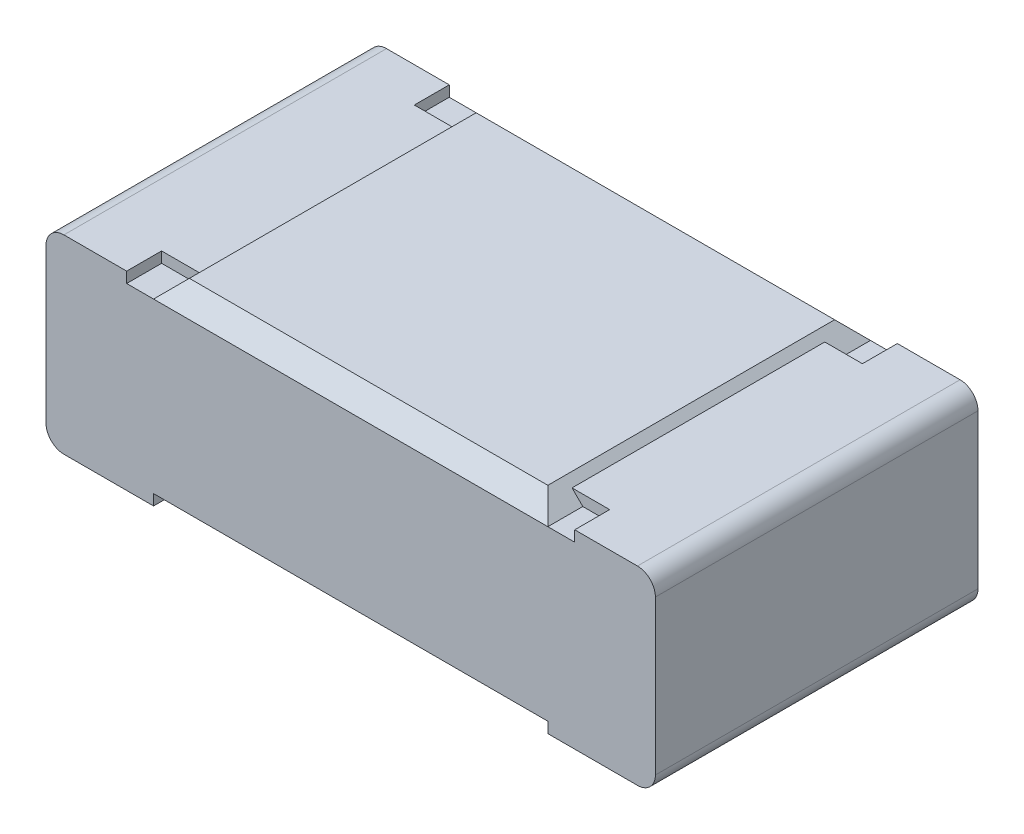
ISO-10303-21;
HEADER;
FILE_DESCRIPTION(('STEP AP214'),'2;1');
FILE_NAME('part.step','',(''),(''),'','','');
FILE_SCHEMA(('AUTOMOTIVE_DESIGN { 1 0 10303 214 1 1 1 1 }'));
ENDSEC;
DATA;
#1=APPLICATION_CONTEXT('core data for automotive mechanical design processes');
#2=APPLICATION_PROTOCOL_DEFINITION('international standard','automotive_design',2000,#1);
#3=PRODUCT_CONTEXT('',#1,'mechanical');
#4=PRODUCT('Part','Part','',(#3));
#5=PRODUCT_RELATED_PRODUCT_CATEGORY('part','',(#4));
#6=PRODUCT_DEFINITION_FORMATION('','',#4);
#7=PRODUCT_DEFINITION_CONTEXT('part definition',#1,'design');
#8=PRODUCT_DEFINITION('design','',#6,#7);
#9=PRODUCT_DEFINITION_SHAPE('','',#8);
#10=(LENGTH_UNIT() NAMED_UNIT(*) SI_UNIT(.MILLI.,.METRE.));
#11=(NAMED_UNIT(*) PLANE_ANGLE_UNIT() SI_UNIT($,.RADIAN.));
#12=(NAMED_UNIT(*) SI_UNIT($,.STERADIAN.) SOLID_ANGLE_UNIT());
#13=UNCERTAINTY_MEASURE_WITH_UNIT(LENGTH_MEASURE(1.E-05),#10,'distance_accuracy_value','');
#14=(GEOMETRIC_REPRESENTATION_CONTEXT(3) GLOBAL_UNCERTAINTY_ASSIGNED_CONTEXT((#13)) GLOBAL_UNIT_ASSIGNED_CONTEXT((#10,
#11,#12)) REPRESENTATION_CONTEXT('',''));
#15=CARTESIAN_POINT('',(0.,0.,0.));
#16=DIRECTION('',(0.,0.,1.));
#17=DIRECTION('',(1.,0.,0.));
#18=AXIS2_PLACEMENT_3D('',#15,#16,#17);
#19=CARTESIAN_POINT('',(-2.052710129873,-22.36241512988,3.046662858095));
#20=DIRECTION('',(1.,5.246547753537E-10,0.));
#21=DIRECTION('',(-5.246547753537E-10,1.,0.));
#22=AXIS2_PLACEMENT_3D('',#19,#20,#21);
#23=PLANE('',#22);
#24=DIRECTION('',(-5.246547753537E-10,1.,0.));
#25=VECTOR('',#24,1.);
#26=CARTESIAN_POINT('',(-2.052710129873,-22.36241512988,2.949162858095));
#27=LINE('',#26,#25);
#28=CARTESIAN_POINT('',(-2.052710129873,-22.362415130045,2.949162858095));
#29=VERTEX_POINT('',#28);
#30=CARTESIAN_POINT('',(-2.05271012988358,-22.3324151298794,2.949162858095));
#31=VERTEX_POINT('',#30);
#32=EDGE_CURVE('E396',#29,#31,#27,.T.);
#33=ORIENTED_EDGE('',*,*,#32,.F.);
#34=DIRECTION('',(0.,0.,1.));
#35=VECTOR('',#34,1.);
#36=CARTESIAN_POINT('',(-2.052710129873,-22.36241513021,3.849162858095));
#37=LINE('',#36,#35);
#38=CARTESIAN_POINT('',(-2.052710129873,-22.36241513021,3.046662858095));
#39=VERTEX_POINT('',#38);
#40=EDGE_CURVE('E246',#39,#29,#37,.F.);
#41=ORIENTED_EDGE('',*,*,#40,.F.);
#42=DIRECTION('',(0.,1.,0.));
#43=VECTOR('',#42,1.);
#44=CARTESIAN_POINT('',(-2.052710129873,-22.36241513053,3.046662858095));
#45=LINE('',#44,#43);
#46=CARTESIAN_POINT('',(-2.05271012988367,-22.3324151298788,3.046662858095));
#47=VERTEX_POINT('',#46);
#48=EDGE_CURVE('E380',#39,#47,#45,.T.);
#49=ORIENTED_EDGE('',*,*,#48,.T.);
#50=DIRECTION('',(0.,0.,1.));
#51=VECTOR('',#50,1.);
#52=CARTESIAN_POINT('',(-2.052710129889,-22.3324151298782,3.849162858095));
#53=LINE('',#52,#51);
#54=EDGE_CURVE('E341',#31,#47,#53,.T.);
#55=ORIENTED_EDGE('',*,*,#54,.F.);
#56=EDGE_LOOP('',(#33,#41,#49,#55));
#57=FACE_BOUND('',#56,.T.);
#58=ADVANCED_FACE('F17',(#57),#23,.F.);
#59=CARTESIAN_POINT('',(-3.302710129873,-22.36241513053,3.046662858095));
#60=DIRECTION('',(0.,0.,1.));
#61=DIRECTION('',(1.,0.,0.));
#62=AXIS2_PLACEMENT_3D('',#59,#60,#61);
#63=PLANE('',#62);
#64=DIRECTION('',(-1.,-5.246535065274E-10,0.));
#65=VECTOR('',#64,1.);
#66=CARTESIAN_POINT('',(-2.227710129889,-22.33241512997,3.046662858095));
#67=LINE('',#66,#65);
#68=CARTESIAN_POINT('',(-2.15771012988567,-22.3324151299338,3.046662858095));
#69=VERTEX_POINT('',#68);
#70=EDGE_CURVE('E337',#47,#69,#67,.T.);
#71=ORIENTED_EDGE('',*,*,#70,.F.);
#72=ORIENTED_EDGE('',*,*,#48,.F.);
#73=DIRECTION('',(-1.,0.,0.));
#74=VECTOR('',#73,1.);
#75=CARTESIAN_POINT('',(-3.477710129611,-22.36241513021,3.046662858095));
#76=LINE('',#75,#74);
#77=CARTESIAN_POINT('',(-2.127710129611,-22.36241513021,3.046662858095));
#78=VERTEX_POINT('',#77);
#79=EDGE_CURVE('E225',#78,#39,#76,.F.);
#80=ORIENTED_EDGE('',*,*,#79,.F.);
#81=DIRECTION('',(-0.707106781186548,0.707106781186548,0.));
#82=VECTOR('',#81,1.);
#83=CARTESIAN_POINT('',(-2.127710129611,-22.36241513021,3.046662858095));
#84=LINE('',#83,#82);
#85=EDGE_CURVE('E300',#69,#78,#84,.F.);
#86=ORIENTED_EDGE('',*,*,#85,.F.);
#87=EDGE_LOOP('',(#71,#72,#80,#86));
#88=FACE_BOUND('',#87,.T.);
#89=ADVANCED_FACE('F576',(#88),#63,.F.);
#90=CARTESIAN_POINT('',(-3.302710129873,-22.36241513053,2.949162858095));
#91=DIRECTION('',(-1.,-5.246547753537E-10,0.));
#92=DIRECTION('',(5.246547753537E-10,-1.,0.));
#93=AXIS2_PLACEMENT_3D('',#90,#91,#92);
#94=PLANE('',#93);
#95=DIRECTION('',(0.,1.,0.));
#96=VECTOR('',#95,1.);
#97=CARTESIAN_POINT('',(-3.302710129889,-22.36241513053,3.046662858095));
#98=LINE('',#97,#96);
#99=CARTESIAN_POINT('',(-3.302710129889,-22.3324151305188,3.046662858095));
#100=VERTEX_POINT('',#99);
#101=CARTESIAN_POINT('',(-3.30271012987833,-22.36241513021,3.046662858095));
#102=VERTEX_POINT('',#101);
#103=EDGE_CURVE('E363',#100,#102,#98,.F.);
#104=ORIENTED_EDGE('',*,*,#103,.T.);
#105=DIRECTION('',(0.,0.,1.));
#106=VECTOR('',#105,1.);
#107=CARTESIAN_POINT('',(-3.302710129873,-22.36241513021,3.849162858095));
#108=LINE('',#107,#106);
#109=CARTESIAN_POINT('',(-3.302710129877,-22.36241513045,2.949162858095));
#110=VERTEX_POINT('',#109);
#111=EDGE_CURVE('E376',#110,#102,#108,.T.);
#112=ORIENTED_EDGE('',*,*,#111,.F.);
#113=DIRECTION('',(0.,1.,0.));
#114=VECTOR('',#113,1.);
#115=CARTESIAN_POINT('',(-3.302710129889,-22.86241513021,2.949162858095));
#116=LINE('',#115,#114);
#117=CARTESIAN_POINT('',(-3.302710129889,-22.3324151305994,2.949162858095));
#118=VERTEX_POINT('',#117);
#119=EDGE_CURVE('E236',#118,#110,#116,.F.);
#120=ORIENTED_EDGE('',*,*,#119,.F.);
#121=DIRECTION('',(0.,0.,1.));
#122=VECTOR('',#121,1.);
#123=CARTESIAN_POINT('',(-3.302710129889,-22.3324151305382,3.849162858095));
#124=LINE('',#123,#122);
#125=EDGE_CURVE('E322',#100,#118,#124,.F.);
#126=ORIENTED_EDGE('',*,*,#125,.F.);
#127=EDGE_LOOP('',(#104,#112,#120,#126));
#128=FACE_BOUND('',#127,.T.);
#129=ADVANCED_FACE('F927',(#128),#94,.F.);
#130=CARTESIAN_POINT('',(-3.302710129873,-22.36241513053,3.046662858095));
#131=DIRECTION('',(0.,0.,1.));
#132=DIRECTION('',(1.,0.,0.));
#133=AXIS2_PLACEMENT_3D('',#130,#131,#132);
#134=PLANE('',#133);
#135=DIRECTION('',(-1.,0.,0.));
#136=VECTOR('',#135,1.);
#137=CARTESIAN_POINT('',(-3.477710129611,-22.36241513021,3.046662858095));
#138=LINE('',#137,#136);
#139=CARTESIAN_POINT('',(-3.227710129611,-22.36241513021,3.046662858095));
#140=VERTEX_POINT('',#139);
#141=EDGE_CURVE('E276',#102,#140,#138,.F.);
#142=ORIENTED_EDGE('',*,*,#141,.F.);
#143=ORIENTED_EDGE('',*,*,#103,.F.);
#144=DIRECTION('',(-1.,-5.24653823734E-10,0.));
#145=VECTOR('',#144,1.);
#146=CARTESIAN_POINT('',(-3.477710129889,-22.33241513063,3.046662858095));
#147=LINE('',#146,#145);
#148=CARTESIAN_POINT('',(-3.197710129882,-22.3324151304817,3.046662858095));
#149=VERTEX_POINT('',#148);
#150=EDGE_CURVE('E326',#149,#100,#147,.T.);
#151=ORIENTED_EDGE('',*,*,#150,.F.);
#152=DIRECTION('',(-0.707106781186548,-0.707106781186548,0.));
#153=VECTOR('',#152,1.);
#154=CARTESIAN_POINT('',(-3.227710129611,-22.36241513021,3.046662858095));
#155=LINE('',#154,#153);
#156=EDGE_CURVE('E299',#140,#149,#155,.F.);
#157=ORIENTED_EDGE('',*,*,#156,.F.);
#158=EDGE_LOOP('',(#142,#143,#151,#157));
#159=FACE_BOUND('',#158,.T.);
#160=ADVANCED_FACE('F633',(#159),#134,.F.);
#161=CARTESIAN_POINT('',(-2.052710129873,-22.36241512988,3.849162858095));
#162=DIRECTION('',(1.,5.246547753537E-10,0.));
#163=DIRECTION('',(-5.246547753537E-10,1.,0.));
#164=AXIS2_PLACEMENT_3D('',#161,#162,#163);
#165=PLANE('',#164);
#166=DIRECTION('',(0.,1.,0.));
#167=VECTOR('',#166,1.);
#168=CARTESIAN_POINT('',(-2.052710129889,-22.36241512988,3.751662858095));
#169=LINE('',#168,#167);
#170=CARTESIAN_POINT('',(-2.052710129889,-22.3324151298955,3.751662858095));
#171=VERTEX_POINT('',#170);
#172=CARTESIAN_POINT('',(-2.05271012987833,-22.36241513021,3.751662858095));
#173=VERTEX_POINT('',#172);
#174=EDGE_CURVE('E357',#171,#173,#169,.F.);
#175=ORIENTED_EDGE('',*,*,#174,.T.);
#176=DIRECTION('',(0.,0.,1.));
#177=VECTOR('',#176,1.);
#178=CARTESIAN_POINT('',(-2.052710129873,-22.36241513021,3.849162858095));
#179=LINE('',#178,#177);
#180=CARTESIAN_POINT('',(-2.052710129873,-22.362415130045,3.849162858095));
#181=VERTEX_POINT('',#180);
#182=EDGE_CURVE('E334',#181,#173,#179,.F.);
#183=ORIENTED_EDGE('',*,*,#182,.F.);
#184=DIRECTION('',(-5.246547753537E-10,1.,0.));
#185=VECTOR('',#184,1.);
#186=CARTESIAN_POINT('',(-2.052710129873,-22.36241512988,3.849162858095));
#187=LINE('',#186,#185);
#188=CARTESIAN_POINT('',(-2.05271012988358,-22.3324151298794,3.849162858095));
#189=VERTEX_POINT('',#188);
#190=EDGE_CURVE('E359',#189,#181,#187,.F.);
#191=ORIENTED_EDGE('',*,*,#190,.F.);
#192=DIRECTION('',(0.,0.,1.));
#193=VECTOR('',#192,1.);
#194=CARTESIAN_POINT('',(-2.052710129889,-22.3324151298782,3.849162858095));
#195=LINE('',#194,#193);
#196=EDGE_CURVE('E338',#171,#189,#195,.T.);
#197=ORIENTED_EDGE('',*,*,#196,.F.);
#198=EDGE_LOOP('',(#175,#183,#191,#197));
#199=FACE_BOUND('',#198,.T.);
#200=ADVANCED_FACE('F598',(#199),#165,.F.);
#201=CARTESIAN_POINT('',(-2.052710129873,-22.36241512988,3.751662858095));
#202=DIRECTION('',(0.,0.,-1.));
#203=DIRECTION('',(0.,1.,0.));
#204=AXIS2_PLACEMENT_3D('',#201,#202,#203);
#205=PLANE('',#204);
#206=DIRECTION('',(-1.,0.,0.));
#207=VECTOR('',#206,1.);
#208=CARTESIAN_POINT('',(-3.477710129611,-22.36241513021,3.751662858095));
#209=LINE('',#208,#207);
#210=CARTESIAN_POINT('',(-2.127710129611,-22.36241513021,3.751662858095));
#211=VERTEX_POINT('',#210);
#212=EDGE_CURVE('E351',#173,#211,#209,.T.);
#213=ORIENTED_EDGE('',*,*,#212,.F.);
#214=ORIENTED_EDGE('',*,*,#174,.F.);
#215=DIRECTION('',(-1.,-5.246535065274E-10,0.));
#216=VECTOR('',#215,1.);
#217=CARTESIAN_POINT('',(-2.227710129889,-22.33241512997,3.751662858095));
#218=LINE('',#217,#216);
#219=CARTESIAN_POINT('',(-2.157710129887,-22.3324151299338,3.751662858095));
#220=VERTEX_POINT('',#219);
#221=EDGE_CURVE('E342',#220,#171,#218,.F.);
#222=ORIENTED_EDGE('',*,*,#221,.F.);
#223=DIRECTION('',(-0.707106781186548,0.707106781186548,0.));
#224=VECTOR('',#223,1.);
#225=CARTESIAN_POINT('',(-2.127710129611,-22.36241513021,3.751662858095));
#226=LINE('',#225,#224);
#227=EDGE_CURVE('E345',#211,#220,#226,.T.);
#228=ORIENTED_EDGE('',*,*,#227,.F.);
#229=EDGE_LOOP('',(#213,#214,#222,#228));
#230=FACE_BOUND('',#229,.T.);
#231=ADVANCED_FACE('F566',(#230),#205,.F.);
#232=CARTESIAN_POINT('',(-2.227710129889,-22.33241512997,3.849162858095));
#233=DIRECTION('',(-5.246535065274E-10,1.,0.));
#234=DIRECTION('',(-1.,-5.246535065274E-10,0.));
#235=AXIS2_PLACEMENT_3D('',#232,#233,#234);
#236=PLANE('',#235);
#237=ORIENTED_EDGE('',*,*,#54,.T.);
#238=ORIENTED_EDGE('',*,*,#70,.T.);
#239=DIRECTION('',(0.,0.,1.));
#240=VECTOR('',#239,1.);
#241=CARTESIAN_POINT('',(-2.157710129887,-22.332415129934,3.849162858095));
#242=LINE('',#241,#240);
#243=EDGE_CURVE('E348',#220,#69,#242,.F.);
#244=ORIENTED_EDGE('',*,*,#243,.F.);
#245=ORIENTED_EDGE('',*,*,#221,.T.);
#246=ORIENTED_EDGE('',*,*,#196,.T.);
#247=DIRECTION('',(1.,0.,0.));
#248=VECTOR('',#247,1.);
#249=CARTESIAN_POINT('',(-2.677710129611,-22.33241512988,3.849162858095));
#250=LINE('',#249,#248);
#251=CARTESIAN_POINT('',(-1.877710129862,-22.332415129835,3.849162858095));
#252=VERTEX_POINT('',#251);
#253=EDGE_CURVE('E448',#189,#252,#250,.T.);
#254=ORIENTED_EDGE('',*,*,#253,.T.);
#255=DIRECTION('',(0.,0.,-1.));
#256=VECTOR('',#255,1.);
#257=CARTESIAN_POINT('',(-1.877710129862,-22.33241512979,3.849162858095));
#258=LINE('',#257,#256);
#259=CARTESIAN_POINT('',(-1.877710129862,-22.332415129835,2.949162858095));
#260=VERTEX_POINT('',#259);
#261=EDGE_CURVE('E198',#260,#252,#258,.F.);
#262=ORIENTED_EDGE('',*,*,#261,.F.);
#263=DIRECTION('',(1.,0.,0.));
#264=VECTOR('',#263,1.);
#265=CARTESIAN_POINT('',(-2.677710129611,-22.33241512988,2.949162858095));
#266=LINE('',#265,#264);
#267=EDGE_CURVE('E224',#31,#260,#266,.T.);
#268=ORIENTED_EDGE('',*,*,#267,.F.);
#269=EDGE_LOOP('',(#237,#238,#244,#245,#246,#254,#262,#268));
#270=FACE_BOUND('',#269,.T.);
#271=ADVANCED_FACE('F571',(#270),#236,.T.);
#272=CARTESIAN_POINT('',(-1.877710129862,-22.38241512979,3.849162858095));
#273=DIRECTION('',(0.,0.,-1.));
#274=DIRECTION('',(0.,1.,0.));
#275=AXIS2_PLACEMENT_3D('',#272,#273,#274);
#276=CYLINDRICAL_SURFACE('',#275,0.05);
#277=CARTESIAN_POINT('',(-1.877710129862,-22.38241512979,2.949162858095));
#278=DIRECTION('',(0.,0.,-1.));
#279=DIRECTION('',(0.,1.,0.));
#280=AXIS2_PLACEMENT_3D('',#277,#278,#279);
#281=CIRCLE('',#280,0.05);
#282=CARTESIAN_POINT('',(-1.827710129862,-22.382415129775,2.949162858095));
#283=VERTEX_POINT('',#282);
#284=EDGE_CURVE('E20',#260,#283,#281,.T.);
#285=ORIENTED_EDGE('',*,*,#284,.F.);
#286=ORIENTED_EDGE('',*,*,#261,.T.);
#287=CARTESIAN_POINT('',(-1.877710129862,-22.38241512979,3.849162858095));
#288=DIRECTION('',(0.,0.,-1.));
#289=DIRECTION('',(0.,1.,0.));
#290=AXIS2_PLACEMENT_3D('',#287,#288,#289);
#291=CIRCLE('',#290,0.05);
#292=CARTESIAN_POINT('',(-1.827710129862,-22.382415129775,3.849162858095));
#293=VERTEX_POINT('',#292);
#294=EDGE_CURVE('E209',#252,#293,#291,.T.);
#295=ORIENTED_EDGE('',*,*,#294,.T.);
#296=DIRECTION('',(0.,0.,1.));
#297=VECTOR('',#296,1.);
#298=CARTESIAN_POINT('',(-1.827710129862,-22.38241512976,3.849162858095));
#299=LINE('',#298,#297);
#300=EDGE_CURVE('E203',#283,#293,#299,.T.);
#301=ORIENTED_EDGE('',*,*,#300,.F.);
#302=EDGE_LOOP('',(#285,#286,#295,#301));
#303=FACE_BOUND('',#302,.T.);
#304=ADVANCED_FACE('F205',(#303),#276,.T.);
#305=CARTESIAN_POINT('',(-1.827710129862,-22.38241512976,3.849162858095));
#306=DIRECTION('',(1.,5.246545171623E-10,0.));
#307=DIRECTION('',(-5.246545171623E-10,1.,0.));
#308=AXIS2_PLACEMENT_3D('',#305,#306,#307);
#309=PLANE('',#308);
#310=DIRECTION('',(0.,1.,0.));
#311=VECTOR('',#310,1.);
#312=CARTESIAN_POINT('',(-1.827710129862,-22.86241513021,2.949162858095));
#313=LINE('',#312,#311);
#314=CARTESIAN_POINT('',(-1.8277101297495,-22.812415129775,2.949162858095));
#315=VERTEX_POINT('',#314);
#316=EDGE_CURVE('E215',#283,#315,#313,.F.);
#317=ORIENTED_EDGE('',*,*,#316,.F.);
#318=ORIENTED_EDGE('',*,*,#300,.T.);
#319=DIRECTION('',(0.,1.,0.));
#320=VECTOR('',#319,1.);
#321=CARTESIAN_POINT('',(-1.827710129862,-22.86241513021,3.849162858095));
#322=LINE('',#321,#320);
#323=CARTESIAN_POINT('',(-1.8277101297495,-22.812415129775,3.849162858095));
#324=VERTEX_POINT('',#323);
#325=EDGE_CURVE('E446',#293,#324,#322,.F.);
#326=ORIENTED_EDGE('',*,*,#325,.T.);
#327=DIRECTION('',(0.,0.,-1.));
#328=VECTOR('',#327,1.);
#329=CARTESIAN_POINT('',(-1.827710129637,-22.81241512976,3.849162858095));
#330=LINE('',#329,#328);
#331=EDGE_CURVE('E212',#315,#324,#330,.F.);
#332=ORIENTED_EDGE('',*,*,#331,.F.);
#333=EDGE_LOOP('',(#317,#318,#326,#332));
#334=FACE_BOUND('',#333,.T.);
#335=ADVANCED_FACE('F216',(#334),#309,.T.);
#336=CARTESIAN_POINT('',(-1.877710129637,-22.81241512979,3.849162858095));
#337=DIRECTION('',(0.,0.,-1.));
#338=DIRECTION('',(0.,1.,0.));
#339=AXIS2_PLACEMENT_3D('',#336,#337,#338);
#340=CYLINDRICAL_SURFACE('',#339,0.05);
#341=CARTESIAN_POINT('',(-1.877710129637,-22.81241512979,2.949162858095));
#342=DIRECTION('',(0.,0.,-1.));
#343=DIRECTION('',(0.,1.,0.));
#344=AXIS2_PLACEMENT_3D('',#341,#342,#343);
#345=CIRCLE('',#344,0.05);
#346=CARTESIAN_POINT('',(-1.87771012961088,-22.86241512979,2.949162858095));
#347=VERTEX_POINT('',#346);
#348=EDGE_CURVE('E220',#315,#347,#345,.T.);
#349=ORIENTED_EDGE('',*,*,#348,.F.);
#350=ORIENTED_EDGE('',*,*,#331,.T.);
#351=CARTESIAN_POINT('',(-1.877710129637,-22.81241512979,3.849162858095));
#352=DIRECTION('',(0.,0.,-1.));
#353=DIRECTION('',(0.,1.,0.));
#354=AXIS2_PLACEMENT_3D('',#351,#352,#353);
#355=CIRCLE('',#354,0.05);
#356=CARTESIAN_POINT('',(-1.877710129624,-22.86241512979,3.849162858095));
#357=VERTEX_POINT('',#356);
#358=EDGE_CURVE('E443',#324,#357,#355,.T.);
#359=ORIENTED_EDGE('',*,*,#358,.T.);
#360=DIRECTION('',(0.,0.,1.));
#361=VECTOR('',#360,1.);
#362=CARTESIAN_POINT('',(-1.877710129611,-22.86241512979,3.849162858095));
#363=LINE('',#362,#361);
#364=EDGE_CURVE('E331',#347,#357,#363,.T.);
#365=ORIENTED_EDGE('',*,*,#364,.F.);
#366=EDGE_LOOP('',(#349,#350,#359,#365));
#367=FACE_BOUND('',#366,.T.);
#368=ADVANCED_FACE('F461',(#367),#340,.T.);
#369=CARTESIAN_POINT('',(-3.477710129637,-22.81241513063,3.849162858095));
#370=DIRECTION('',(0.,0.,-1.));
#371=DIRECTION('',(0.,1.,0.));
#372=AXIS2_PLACEMENT_3D('',#369,#370,#371);
#373=CYLINDRICAL_SURFACE('',#372,0.05);
#374=CARTESIAN_POINT('',(-3.477710129637,-22.81241513063,2.949162858095));
#375=DIRECTION('',(0.,0.,-1.));
#376=DIRECTION('',(0.,1.,0.));
#377=AXIS2_PLACEMENT_3D('',#374,#375,#376);
#378=CIRCLE('',#377,0.05);
#379=CARTESIAN_POINT('',(-3.477710129624,-22.8624151305556,2.949162858095));
#380=VERTEX_POINT('',#379);
#381=CARTESIAN_POINT('',(-3.527710129637,-22.81241513064,2.949162858095));
#382=VERTEX_POINT('',#381);
#383=EDGE_CURVE('E454',#380,#382,#378,.T.);
#384=ORIENTED_EDGE('',*,*,#383,.F.);
#385=DIRECTION('',(0.,0.,1.));
#386=VECTOR('',#385,1.);
#387=CARTESIAN_POINT('',(-3.477710129611,-22.8624151306212,3.849162858095));
#388=LINE('',#387,#386);
#389=CARTESIAN_POINT('',(-3.477710129624,-22.8624151305556,3.849162858095));
#390=VERTEX_POINT('',#389);
#391=EDGE_CURVE('E269',#390,#380,#388,.F.);
#392=ORIENTED_EDGE('',*,*,#391,.F.);
#393=CARTESIAN_POINT('',(-3.477710129637,-22.81241513063,3.849162858095));
#394=DIRECTION('',(0.,0.,-1.));
#395=DIRECTION('',(0.,1.,0.));
#396=AXIS2_PLACEMENT_3D('',#393,#394,#395);
#397=CIRCLE('',#396,0.05);
#398=CARTESIAN_POINT('',(-3.527710129637,-22.81241513064,3.849162858095));
#399=VERTEX_POINT('',#398);
#400=EDGE_CURVE('E440',#390,#399,#397,.T.);
#401=ORIENTED_EDGE('',*,*,#400,.T.);
#402=DIRECTION('',(0.,0.,1.));
#403=VECTOR('',#402,1.);
#404=CARTESIAN_POINT('',(-3.527710129637,-22.81241513065,3.849162858095));
#405=LINE('',#404,#403);
#406=EDGE_CURVE('E327',#382,#399,#405,.T.);
#407=ORIENTED_EDGE('',*,*,#406,.F.);
#408=EDGE_LOOP('',(#384,#392,#401,#407));
#409=FACE_BOUND('',#408,.T.);
#410=ADVANCED_FACE('F611',(#409),#373,.T.);
#411=CARTESIAN_POINT('',(-3.527710129637,-22.81241513065,3.849162858095));
#412=DIRECTION('',(-1.,-5.246547753537E-10,0.));
#413=DIRECTION('',(5.246547753537E-10,-1.,0.));
#414=AXIS2_PLACEMENT_3D('',#411,#412,#413);
#415=PLANE('',#414);
#416=DIRECTION('',(0.,1.,0.));
#417=VECTOR('',#416,1.);
#418=CARTESIAN_POINT('',(-3.527710129637,-22.86241513021,2.949162858095));
#419=LINE('',#418,#417);
#420=CARTESIAN_POINT('',(-3.5277101297495,-22.38241513064,2.949162858095));
#421=VERTEX_POINT('',#420);
#422=EDGE_CURVE('E453',#382,#421,#419,.T.);
#423=ORIENTED_EDGE('',*,*,#422,.F.);
#424=ORIENTED_EDGE('',*,*,#406,.T.);
#425=DIRECTION('',(0.,1.,0.));
#426=VECTOR('',#425,1.);
#427=CARTESIAN_POINT('',(-3.527710129637,-22.86241513021,3.849162858095));
#428=LINE('',#427,#426);
#429=CARTESIAN_POINT('',(-3.5277101297495,-22.38241513064,3.849162858095));
#430=VERTEX_POINT('',#429);
#431=EDGE_CURVE('E439',#399,#430,#428,.T.);
#432=ORIENTED_EDGE('',*,*,#431,.T.);
#433=DIRECTION('',(0.,0.,-1.));
#434=VECTOR('',#433,1.);
#435=CARTESIAN_POINT('',(-3.527710129862,-22.38241513065,3.849162858095));
#436=LINE('',#435,#434);
#437=EDGE_CURVE('E323',#421,#430,#436,.F.);
#438=ORIENTED_EDGE('',*,*,#437,.F.);
#439=EDGE_LOOP('',(#423,#424,#432,#438));
#440=FACE_BOUND('',#439,.T.);
#441=ADVANCED_FACE('F615',(#440),#415,.T.);
#442=CARTESIAN_POINT('',(-3.477710129862,-22.38241513063,3.849162858095));
#443=DIRECTION('',(0.,0.,-1.));
#444=DIRECTION('',(0.,1.,0.));
#445=AXIS2_PLACEMENT_3D('',#442,#443,#444);
#446=CYLINDRICAL_SURFACE('',#445,0.05);
#447=CARTESIAN_POINT('',(-3.477710129862,-22.38241513063,2.949162858095));
#448=DIRECTION('',(0.,0.,-1.));
#449=DIRECTION('',(0.,1.,0.));
#450=AXIS2_PLACEMENT_3D('',#447,#448,#449);
#451=CIRCLE('',#450,0.05);
#452=CARTESIAN_POINT('',(-3.4777101298755,-22.33241513063,2.949162858095));
#453=VERTEX_POINT('',#452);
#454=EDGE_CURVE('E449',#421,#453,#451,.T.);
#455=ORIENTED_EDGE('',*,*,#454,.F.);
#456=ORIENTED_EDGE('',*,*,#437,.T.);
#457=CARTESIAN_POINT('',(-3.477710129862,-22.38241513063,3.849162858095));
#458=DIRECTION('',(0.,0.,-1.));
#459=DIRECTION('',(0.,1.,0.));
#460=AXIS2_PLACEMENT_3D('',#457,#458,#459);
#461=CIRCLE('',#460,0.05);
#462=CARTESIAN_POINT('',(-3.4777101298755,-22.33241513063,3.849162858095));
#463=VERTEX_POINT('',#462);
#464=EDGE_CURVE('E436',#430,#463,#461,.T.);
#465=ORIENTED_EDGE('',*,*,#464,.T.);
#466=DIRECTION('',(0.,0.,1.));
#467=VECTOR('',#466,1.);
#468=CARTESIAN_POINT('',(-3.477710129889,-22.33241513063,3.849162858095));
#469=LINE('',#468,#467);
#470=EDGE_CURVE('E317',#453,#463,#469,.T.);
#471=ORIENTED_EDGE('',*,*,#470,.F.);
#472=EDGE_LOOP('',(#455,#456,#465,#471));
#473=FACE_BOUND('',#472,.T.);
#474=ADVANCED_FACE('F619',(#473),#446,.T.);
#475=CARTESIAN_POINT('',(-3.477710129889,-22.33241513063,3.849162858095));
#476=DIRECTION('',(-5.24653823734E-10,1.,0.));
#477=DIRECTION('',(-1.,-5.24653823734E-10,0.));
#478=AXIS2_PLACEMENT_3D('',#475,#476,#477);
#479=PLANE('',#478);
#480=DIRECTION('',(0.,0.,1.));
#481=VECTOR('',#480,1.);
#482=CARTESIAN_POINT('',(-3.30271012988874,-22.33241513053,3.751662858095));
#483=LINE('',#482,#481);
#484=CARTESIAN_POINT('',(-3.30271012988891,-22.3324151305967,3.849162858095));
#485=VERTEX_POINT('',#484);
#486=CARTESIAN_POINT('',(-3.30271012988177,-22.33241513053,3.751662858095));
#487=VERTEX_POINT('',#486);
#488=EDGE_CURVE('E307',#485,#487,#483,.F.);
#489=ORIENTED_EDGE('',*,*,#488,.T.);
#490=DIRECTION('',(1.,0.,0.));
#491=VECTOR('',#490,1.);
#492=CARTESIAN_POINT('',(-2.052710129873,-22.33241513053,3.751662858095));
#493=LINE('',#492,#491);
#494=CARTESIAN_POINT('',(-3.19771012989525,-22.3324151304943,3.751662858095));
#495=VERTEX_POINT('',#494);
#496=EDGE_CURVE('E306',#487,#495,#493,.T.);
#497=ORIENTED_EDGE('',*,*,#496,.T.);
#498=DIRECTION('',(0.,0.,1.));
#499=VECTOR('',#498,1.);
#500=CARTESIAN_POINT('',(-3.197710129882,-22.332415130481,2.949162858095));
#501=LINE('',#500,#499);
#502=EDGE_CURVE('E289',#149,#495,#501,.T.);
#503=ORIENTED_EDGE('',*,*,#502,.F.);
#504=ORIENTED_EDGE('',*,*,#150,.T.);
#505=ORIENTED_EDGE('',*,*,#125,.T.);
#506=DIRECTION('',(1.,0.,0.));
#507=VECTOR('',#506,1.);
#508=CARTESIAN_POINT('',(-2.677710129611,-22.33241513063,2.949162858095));
#509=LINE('',#508,#507);
#510=EDGE_CURVE('E452',#453,#118,#509,.T.);
#511=ORIENTED_EDGE('',*,*,#510,.F.);
#512=ORIENTED_EDGE('',*,*,#470,.T.);
#513=DIRECTION('',(1.,0.,0.));
#514=VECTOR('',#513,1.);
#515=CARTESIAN_POINT('',(-2.677710129611,-22.33241513063,3.849162858095));
#516=LINE('',#515,#514);
#517=EDGE_CURVE('E438',#463,#485,#516,.T.);
#518=ORIENTED_EDGE('',*,*,#517,.T.);
#519=EDGE_LOOP('',(#489,#497,#503,#504,#505,#511,#512,#518));
#520=FACE_BOUND('',#519,.T.);
#521=ADVANCED_FACE('F623',(#520),#479,.T.);
#522=CARTESIAN_POINT('',(-3.302710129873,-22.36241513053,3.751662858095));
#523=DIRECTION('',(-1.,-5.246547753537E-10,0.));
#524=DIRECTION('',(5.246547753537E-10,-1.,0.));
#525=AXIS2_PLACEMENT_3D('',#522,#523,#524);
#526=PLANE('',#525);
#527=DIRECTION('',(0.,1.,0.));
#528=VECTOR('',#527,1.);
#529=CARTESIAN_POINT('',(-3.302710129889,-22.86241513021,3.849162858095));
#530=LINE('',#529,#528);
#531=CARTESIAN_POINT('',(-3.302710129877,-22.36241513045,3.849162858095));
#532=VERTEX_POINT('',#531);
#533=EDGE_CURVE('E646',#485,#532,#530,.F.);
#534=ORIENTED_EDGE('',*,*,#533,.T.);
#535=DIRECTION('',(0.,0.,1.));
#536=VECTOR('',#535,1.);
#537=CARTESIAN_POINT('',(-3.302710129873,-22.36241513021,3.849162858095));
#538=LINE('',#537,#536);
#539=CARTESIAN_POINT('',(-3.302710129873,-22.36241513021,3.751662858095));
#540=VERTEX_POINT('',#539);
#541=EDGE_CURVE('E644',#540,#532,#538,.T.);
#542=ORIENTED_EDGE('',*,*,#541,.F.);
#543=DIRECTION('',(0.,1.,0.));
#544=VECTOR('',#543,1.);
#545=CARTESIAN_POINT('',(-3.302710129873,-22.36241512988,3.751662858095));
#546=LINE('',#545,#544);
#547=EDGE_CURVE('E303',#540,#487,#546,.T.);
#548=ORIENTED_EDGE('',*,*,#547,.T.);
#549=ORIENTED_EDGE('',*,*,#488,.F.);
#550=EDGE_LOOP('',(#534,#542,#548,#549));
#551=FACE_BOUND('',#550,.T.);
#552=ADVANCED_FACE('F661',(#551),#526,.F.);
#553=CARTESIAN_POINT('',(-2.052710129873,-22.36241512988,3.751662858095));
#554=DIRECTION('',(0.,0.,-1.));
#555=DIRECTION('',(0.,1.,0.));
#556=AXIS2_PLACEMENT_3D('',#553,#554,#555);
#557=PLANE('',#556);
#558=ORIENTED_EDGE('',*,*,#496,.F.);
#559=ORIENTED_EDGE('',*,*,#547,.F.);
#560=DIRECTION('',(-1.,0.,0.));
#561=VECTOR('',#560,1.);
#562=CARTESIAN_POINT('',(-3.477710129611,-22.36241513021,3.751662858095));
#563=LINE('',#562,#561);
#564=CARTESIAN_POINT('',(-3.227710129611,-22.36241513021,3.751662858095));
#565=VERTEX_POINT('',#564);
#566=EDGE_CURVE('E310',#565,#540,#563,.T.);
#567=ORIENTED_EDGE('',*,*,#566,.F.);
#568=DIRECTION('',(-0.707106781186548,-0.707106781186548,0.));
#569=VECTOR('',#568,1.);
#570=CARTESIAN_POINT('',(-3.227710129611,-22.36241513021,3.751662858095));
#571=LINE('',#570,#569);
#572=EDGE_CURVE('E285',#495,#565,#571,.T.);
#573=ORIENTED_EDGE('',*,*,#572,.F.);
#574=EDGE_LOOP('',(#558,#559,#567,#573));
#575=FACE_BOUND('',#574,.T.);
#576=ADVANCED_FACE('F640',(#575),#557,.F.);
#577=CARTESIAN_POINT('',(-2.127710129611,-22.36241513021,3.849162858095));
#578=DIRECTION('',(0.707106781186548,0.707106781186548,0.));
#579=DIRECTION('',(-0.707106781186548,0.707106781186548,0.));
#580=AXIS2_PLACEMENT_3D('',#577,#578,#579);
#581=PLANE('',#580);
#582=DIRECTION('',(-0.577350269189616,0.577350269189631,-0.577350269189631));
#583=VECTOR('',#582,1.);
#584=CARTESIAN_POINT('',(-2.127710129611,-22.36241513021,3.849162858095));
#585=LINE('',#584,#583);
#586=CARTESIAN_POINT('',(-2.127710129611,-22.36241513021,3.849162858095));
#587=VERTEX_POINT('',#586);
#588=CARTESIAN_POINT('',(-2.177710129611,-22.31241513021,3.799162858095));
#589=VERTEX_POINT('',#588);
#590=EDGE_CURVE('E294',#587,#589,#585,.T.);
#591=ORIENTED_EDGE('',*,*,#590,.F.);
#592=DIRECTION('',(0.,0.,1.));
#593=VECTOR('',#592,1.);
#594=CARTESIAN_POINT('',(-2.127710129611,-22.36241513021,3.849162858095));
#595=LINE('',#594,#593);
#596=EDGE_CURVE('E354',#211,#587,#595,.T.);
#597=ORIENTED_EDGE('',*,*,#596,.F.);
#598=ORIENTED_EDGE('',*,*,#227,.T.);
#599=ORIENTED_EDGE('',*,*,#243,.T.);
#600=ORIENTED_EDGE('',*,*,#85,.T.);
#601=DIRECTION('',(0.,0.,1.));
#602=VECTOR('',#601,1.);
#603=CARTESIAN_POINT('',(-2.127710129611,-22.36241513021,3.849162858095));
#604=LINE('',#603,#602);
#605=CARTESIAN_POINT('',(-2.127710129611,-22.36241513021,2.949162858095));
#606=VERTEX_POINT('',#605);
#607=EDGE_CURVE('E228',#606,#78,#604,.T.);
#608=ORIENTED_EDGE('',*,*,#607,.F.);
#609=DIRECTION('',(0.577350269189616,-0.577350269189631,-0.577350269189631));
#610=VECTOR('',#609,1.);
#611=CARTESIAN_POINT('',(-2.177710129611,-22.31241513021,2.999162858095));
#612=LINE('',#611,#610);
#613=CARTESIAN_POINT('',(-2.177710129611,-22.31241513021,2.999162858095));
#614=VERTEX_POINT('',#613);
#615=EDGE_CURVE('E249',#614,#606,#612,.T.);
#616=ORIENTED_EDGE('',*,*,#615,.F.);
#617=DIRECTION('',(0.,0.,1.));
#618=VECTOR('',#617,1.);
#619=CARTESIAN_POINT('',(-2.177710129611,-22.31241513021,3.399162858095));
#620=LINE('',#619,#618);
#621=EDGE_CURVE('E297',#589,#614,#620,.F.);
#622=ORIENTED_EDGE('',*,*,#621,.F.);
#623=EDGE_LOOP('',(#591,#597,#598,#599,#600,#608,#616,#622));
#624=FACE_BOUND('',#623,.T.);
#625=ADVANCED_FACE('F559',(#624),#581,.T.);
#626=CARTESIAN_POINT('',(-2.677710129611,-22.31241513021,3.399162858095));
#627=DIRECTION('',(0.,1.,0.));
#628=DIRECTION('',(-1.,0.,0.));
#629=AXIS2_PLACEMENT_3D('',#626,#627,#628);
#630=PLANE('',#629);
#631=DIRECTION('',(1.,0.,0.));
#632=VECTOR('',#631,1.);
#633=CARTESIAN_POINT('',(-3.227710129611,-22.31241513021,3.799162858095));
#634=LINE('',#633,#632);
#635=CARTESIAN_POINT('',(-3.177710129611,-22.31241513021,3.799162858095));
#636=VERTEX_POINT('',#635);
#637=EDGE_CURVE('E290',#589,#636,#634,.F.);
#638=ORIENTED_EDGE('',*,*,#637,.F.);
#639=ORIENTED_EDGE('',*,*,#621,.T.);
#640=DIRECTION('',(1.,0.,0.));
#641=VECTOR('',#640,1.);
#642=CARTESIAN_POINT('',(-2.127710129611,-22.31241513021,2.999162858095));
#643=LINE('',#642,#641);
#644=CARTESIAN_POINT('',(-3.177710129611,-22.31241513021,2.999162858095));
#645=VERTEX_POINT('',#644);
#646=EDGE_CURVE('E263',#645,#614,#643,.T.);
#647=ORIENTED_EDGE('',*,*,#646,.F.);
#648=DIRECTION('',(0.,0.,1.));
#649=VECTOR('',#648,1.);
#650=CARTESIAN_POINT('',(-3.177710129611,-22.31241513021,2.949162858095));
#651=LINE('',#650,#649);
#652=EDGE_CURVE('E288',#636,#645,#651,.F.);
#653=ORIENTED_EDGE('',*,*,#652,.F.);
#654=EDGE_LOOP('',(#638,#639,#647,#653));
#655=FACE_BOUND('',#654,.T.);
#656=ADVANCED_FACE('F585',(#655),#630,.T.);
#657=CARTESIAN_POINT('',(-3.227710129611,-22.36241513021,2.949162858095));
#658=DIRECTION('',(-0.707106781186548,0.707106781186548,0.));
#659=DIRECTION('',(-0.707106781186548,-0.707106781186548,0.));
#660=AXIS2_PLACEMENT_3D('',#657,#658,#659);
#661=PLANE('',#660);
#662=DIRECTION('',(0.577350269189614,0.577350269189634,0.577350269189629));
#663=VECTOR('',#662,1.);
#664=CARTESIAN_POINT('',(-3.227710129611,-22.36241513021,2.949162858095));
#665=LINE('',#664,#663);
#666=CARTESIAN_POINT('',(-3.22771012962433,-22.3624151303033,2.94916285808167));
#667=VERTEX_POINT('',#666);
#668=EDGE_CURVE('E266',#667,#645,#665,.T.);
#669=ORIENTED_EDGE('',*,*,#668,.F.);
#670=DIRECTION('',(0.,0.,1.));
#671=VECTOR('',#670,1.);
#672=CARTESIAN_POINT('',(-3.227710129611,-22.36241513021,3.849162858095));
#673=LINE('',#672,#671);
#674=EDGE_CURVE('E272',#140,#667,#673,.F.);
#675=ORIENTED_EDGE('',*,*,#674,.F.);
#676=ORIENTED_EDGE('',*,*,#156,.T.);
#677=ORIENTED_EDGE('',*,*,#502,.T.);
#678=ORIENTED_EDGE('',*,*,#572,.T.);
#679=DIRECTION('',(0.,0.,1.));
#680=VECTOR('',#679,1.);
#681=CARTESIAN_POINT('',(-3.227710129611,-22.36241513021,3.849162858095));
#682=LINE('',#681,#680);
#683=CARTESIAN_POINT('',(-3.227710129611,-22.36241513021,3.849162858095));
#684=VERTEX_POINT('',#683);
#685=EDGE_CURVE('E313',#684,#565,#682,.F.);
#686=ORIENTED_EDGE('',*,*,#685,.F.);
#687=DIRECTION('',(-0.577350269189614,-0.577350269189634,0.577350269189629));
#688=VECTOR('',#687,1.);
#689=CARTESIAN_POINT('',(-3.177710129611,-22.31241513021,3.799162858095));
#690=LINE('',#689,#688);
#691=EDGE_CURVE('E293',#636,#684,#690,.T.);
#692=ORIENTED_EDGE('',*,*,#691,.F.);
#693=ORIENTED_EDGE('',*,*,#652,.T.);
#694=EDGE_LOOP('',(#669,#675,#676,#677,#678,#686,#692,#693));
#695=FACE_BOUND('',#694,.T.);
#696=ADVANCED_FACE('F589',(#695),#661,.T.);
#697=CARTESIAN_POINT('',(-3.227710129611,-22.86241513049,3.849162858095));
#698=DIRECTION('',(5.246539561619E-10,-1.,0.));
#699=DIRECTION('',(1.,5.246539561619E-10,0.));
#700=AXIS2_PLACEMENT_3D('',#697,#698,#699);
#701=PLANE('',#700);
#702=DIRECTION('',(1.,0.,0.));
#703=VECTOR('',#702,1.);
#704=CARTESIAN_POINT('',(-2.677710129611,-22.86241513049,2.949162858095));
#705=LINE('',#704,#703);
#706=CARTESIAN_POINT('',(-3.22771012961551,-22.86241513049,2.949162858095));
#707=VERTEX_POINT('',#706);
#708=EDGE_CURVE('E456',#707,#380,#705,.F.);
#709=ORIENTED_EDGE('',*,*,#708,.F.);
#710=DIRECTION('',(0.,0.,1.));
#711=VECTOR('',#710,1.);
#712=CARTESIAN_POINT('',(-3.22771012961026,-22.86241513049,3.849162858095));
#713=LINE('',#712,#711);
#714=CARTESIAN_POINT('',(-3.22771012961551,-22.86241513049,3.849162858095));
#715=VERTEX_POINT('',#714);
#716=EDGE_CURVE('E279',#715,#707,#713,.F.);
#717=ORIENTED_EDGE('',*,*,#716,.F.);
#718=DIRECTION('',(1.,0.,0.));
#719=VECTOR('',#718,1.);
#720=CARTESIAN_POINT('',(-2.677710129611,-22.86241513049,3.849162858095));
#721=LINE('',#720,#719);
#722=EDGE_CURVE('E442',#715,#390,#721,.F.);
#723=ORIENTED_EDGE('',*,*,#722,.T.);
#724=ORIENTED_EDGE('',*,*,#391,.T.);
#725=EDGE_LOOP('',(#709,#717,#723,#724));
#726=FACE_BOUND('',#725,.T.);
#727=ADVANCED_FACE('F607',(#726),#701,.T.);
#728=CARTESIAN_POINT('',(-2.127710129611,-22.36241513021,2.949162858095));
#729=DIRECTION('',(0.,0.707106781186548,-0.707106781186548));
#730=DIRECTION('',(0.,0.707106781186548,0.707106781186548));
#731=AXIS2_PLACEMENT_3D('',#728,#729,#730);
#732=PLANE('',#731);
#733=ORIENTED_EDGE('',*,*,#646,.T.);
#734=ORIENTED_EDGE('',*,*,#615,.T.);
#735=DIRECTION('',(1.,0.,0.));
#736=VECTOR('',#735,1.);
#737=CARTESIAN_POINT('',(-2.677710129611,-22.36241513021,2.949162858095));
#738=LINE('',#737,#736);
#739=EDGE_CURVE('E243',#667,#606,#738,.T.);
#740=ORIENTED_EDGE('',*,*,#739,.F.);
#741=ORIENTED_EDGE('',*,*,#668,.T.);
#742=EDGE_LOOP('',(#733,#734,#740,#741));
#743=FACE_BOUND('',#742,.T.);
#744=ADVANCED_FACE('F582',(#743),#732,.T.);
#745=CARTESIAN_POINT('',(-3.477710129611,-22.36241513021,3.849162858095));
#746=DIRECTION('',(0.,1.,0.));
#747=DIRECTION('',(-1.,0.,0.));
#748=AXIS2_PLACEMENT_3D('',#745,#746,#747);
#749=PLANE('',#748);
#750=ORIENTED_EDGE('',*,*,#607,.T.);
#751=ORIENTED_EDGE('',*,*,#79,.T.);
#752=ORIENTED_EDGE('',*,*,#40,.T.);
#753=DIRECTION('',(1.,0.,0.));
#754=VECTOR('',#753,1.);
#755=CARTESIAN_POINT('',(-2.677710129611,-22.36241513021,2.949162858095));
#756=LINE('',#755,#754);
#757=EDGE_CURVE('E239',#606,#29,#756,.T.);
#758=ORIENTED_EDGE('',*,*,#757,.F.);
#759=EDGE_LOOP('',(#750,#751,#752,#758));
#760=FACE_BOUND('',#759,.T.);
#761=ADVANCED_FACE('F579',(#760),#749,.T.);
#762=CARTESIAN_POINT('',(-3.477710129611,-22.36241513021,3.849162858095));
#763=DIRECTION('',(0.,1.,0.));
#764=DIRECTION('',(-1.,0.,0.));
#765=AXIS2_PLACEMENT_3D('',#762,#763,#764);
#766=PLANE('',#765);
#767=ORIENTED_EDGE('',*,*,#674,.T.);
#768=DIRECTION('',(1.,0.,0.));
#769=VECTOR('',#768,1.);
#770=CARTESIAN_POINT('',(-2.677710129611,-22.36241513053,2.949162858095));
#771=LINE('',#770,#769);
#772=EDGE_CURVE('E242',#110,#667,#771,.T.);
#773=ORIENTED_EDGE('',*,*,#772,.F.);
#774=ORIENTED_EDGE('',*,*,#111,.T.);
#775=ORIENTED_EDGE('',*,*,#141,.T.);
#776=EDGE_LOOP('',(#767,#773,#774,#775));
#777=FACE_BOUND('',#776,.T.);
#778=ADVANCED_FACE('F628',(#777),#766,.T.);
#779=CARTESIAN_POINT('',(-1.877710129611,-22.86241512979,3.849162858095));
#780=DIRECTION('',(5.246539649706E-10,-1.,0.));
#781=DIRECTION('',(1.,5.246539649706E-10,0.));
#782=AXIS2_PLACEMENT_3D('',#779,#780,#781);
#783=PLANE('',#782);
#784=DIRECTION('',(1.,5.246539649706E-10,0.));
#785=VECTOR('',#784,1.);
#786=CARTESIAN_POINT('',(-1.877710129611,-22.86241512979,2.949162858095));
#787=LINE('',#786,#785);
#788=CARTESIAN_POINT('',(-2.127710129611,-22.8624151298771,2.949162858095));
#789=VERTEX_POINT('',#788);
#790=EDGE_CURVE('E275',#789,#347,#787,.T.);
#791=ORIENTED_EDGE('',*,*,#790,.T.);
#792=ORIENTED_EDGE('',*,*,#364,.T.);
#793=DIRECTION('',(1.,0.,0.));
#794=VECTOR('',#793,1.);
#795=CARTESIAN_POINT('',(-2.677710129611,-22.86241512979,3.849162858095));
#796=LINE('',#795,#794);
#797=CARTESIAN_POINT('',(-2.127710129611,-22.8624151298767,3.849162858095));
#798=VERTEX_POINT('',#797);
#799=EDGE_CURVE('E445',#357,#798,#796,.F.);
#800=ORIENTED_EDGE('',*,*,#799,.T.);
#801=DIRECTION('',(0.,0.,1.));
#802=VECTOR('',#801,1.);
#803=CARTESIAN_POINT('',(-2.127710129611,-22.86241512992,3.849162858095));
#804=LINE('',#803,#802);
#805=EDGE_CURVE('E466',#789,#798,#804,.T.);
#806=ORIENTED_EDGE('',*,*,#805,.F.);
#807=EDGE_LOOP('',(#791,#792,#800,#806));
#808=FACE_BOUND('',#807,.T.);
#809=ADVANCED_FACE('F465',(#808),#783,.T.);
#810=CARTESIAN_POINT('',(-3.477710129611,-22.36241513021,3.849162858095));
#811=DIRECTION('',(0.,1.,0.));
#812=DIRECTION('',(-1.,0.,0.));
#813=AXIS2_PLACEMENT_3D('',#810,#811,#812);
#814=PLANE('',#813);
#815=ORIENTED_EDGE('',*,*,#596,.T.);
#816=DIRECTION('',(1.,0.,0.));
#817=VECTOR('',#816,1.);
#818=CARTESIAN_POINT('',(-2.677710129611,-22.36241513021,3.849162858095));
#819=LINE('',#818,#817);
#820=EDGE_CURVE('E467',#587,#181,#819,.T.);
#821=ORIENTED_EDGE('',*,*,#820,.T.);
#822=ORIENTED_EDGE('',*,*,#182,.T.);
#823=ORIENTED_EDGE('',*,*,#212,.T.);
#824=EDGE_LOOP('',(#815,#821,#822,#823));
#825=FACE_BOUND('',#824,.T.);
#826=ADVANCED_FACE('F562',(#825),#814,.T.);
#827=CARTESIAN_POINT('',(-3.477710129611,-22.36241513021,3.849162858095));
#828=DIRECTION('',(0.,1.,0.));
#829=DIRECTION('',(-1.,0.,0.));
#830=AXIS2_PLACEMENT_3D('',#827,#828,#829);
#831=PLANE('',#830);
#832=ORIENTED_EDGE('',*,*,#685,.T.);
#833=ORIENTED_EDGE('',*,*,#566,.T.);
#834=ORIENTED_EDGE('',*,*,#541,.T.);
#835=DIRECTION('',(1.,0.,0.));
#836=VECTOR('',#835,1.);
#837=CARTESIAN_POINT('',(-2.677710129611,-22.36241513053,3.849162858095));
#838=LINE('',#837,#836);
#839=EDGE_CURVE('E470',#532,#684,#838,.T.);
#840=ORIENTED_EDGE('',*,*,#839,.T.);
#841=EDGE_LOOP('',(#832,#833,#834,#840));
#842=FACE_BOUND('',#841,.T.);
#843=ADVANCED_FACE('F643',(#842),#831,.T.);
#844=CARTESIAN_POINT('',(-3.227710129611,-22.36241513021,3.849162858095));
#845=DIRECTION('',(0.,0.707106781186548,0.707106781186548));
#846=DIRECTION('',(0.,-0.707106781186548,0.707106781186548));
#847=AXIS2_PLACEMENT_3D('',#844,#845,#846);
#848=PLANE('',#847);
#849=ORIENTED_EDGE('',*,*,#637,.T.);
#850=ORIENTED_EDGE('',*,*,#691,.T.);
#851=DIRECTION('',(1.,0.,0.));
#852=VECTOR('',#851,1.);
#853=CARTESIAN_POINT('',(-2.677710129611,-22.36241513021,3.849162858095));
#854=LINE('',#853,#852);
#855=EDGE_CURVE('E512',#684,#587,#854,.T.);
#856=ORIENTED_EDGE('',*,*,#855,.T.);
#857=ORIENTED_EDGE('',*,*,#590,.T.);
#858=EDGE_LOOP('',(#849,#850,#856,#857));
#859=FACE_BOUND('',#858,.T.);
#860=ADVANCED_FACE('F553',(#859),#848,.T.);
#861=CARTESIAN_POINT('',(-3.227710129626,-22.83241513049,3.849162858095));
#862=DIRECTION('',(1.,5.246547753537E-10,0.));
#863=DIRECTION('',(-5.246547753537E-10,1.,0.));
#864=AXIS2_PLACEMENT_3D('',#861,#862,#863);
#865=PLANE('',#864);
#866=DIRECTION('',(-5.246547753537E-10,1.,0.));
#867=VECTOR('',#866,1.);
#868=CARTESIAN_POINT('',(-3.227710129626,-22.83241513049,2.949162858095));
#869=LINE('',#868,#867);
#870=CARTESIAN_POINT('',(-3.227710129626,-22.832415130315,2.949162858095));
#871=VERTEX_POINT('',#870);
#872=EDGE_CURVE('E258',#707,#871,#869,.T.);
#873=ORIENTED_EDGE('',*,*,#872,.T.);
#874=DIRECTION('',(0.,0.,1.));
#875=VECTOR('',#874,1.);
#876=CARTESIAN_POINT('',(-3.227710129626,-22.83241513021,3.849162858095));
#877=LINE('',#876,#875);
#878=CARTESIAN_POINT('',(-3.227710129626,-22.83241513035,3.849162858095));
#879=VERTEX_POINT('',#878);
#880=EDGE_CURVE('E506',#879,#871,#877,.F.);
#881=ORIENTED_EDGE('',*,*,#880,.F.);
#882=DIRECTION('',(-5.246547753537E-10,1.,0.));
#883=VECTOR('',#882,1.);
#884=CARTESIAN_POINT('',(-3.227710129626,-22.83241513049,3.849162858095));
#885=LINE('',#884,#883);
#886=EDGE_CURVE('E282',#879,#715,#885,.F.);
#887=ORIENTED_EDGE('',*,*,#886,.T.);
#888=ORIENTED_EDGE('',*,*,#716,.T.);
#889=EDGE_LOOP('',(#873,#881,#887,#888));
#890=FACE_BOUND('',#889,.T.);
#891=ADVANCED_FACE('F604',(#890),#865,.T.);
#892=CARTESIAN_POINT('',(-2.677710129611,-22.86241513021,2.949162858095));
#893=DIRECTION('',(0.,0.,-1.));
#894=DIRECTION('',(0.,1.,0.));
#895=AXIS2_PLACEMENT_3D('',#892,#893,#894);
#896=PLANE('',#895);
#897=DIRECTION('',(1.,0.,0.));
#898=VECTOR('',#897,1.);
#899=CARTESIAN_POINT('',(-1.877710129611,-22.83241513021,2.949162858095));
#900=LINE('',#899,#898);
#901=CARTESIAN_POINT('',(-2.1277101296223,-22.8324151301133,2.949162858095));
#902=VERTEX_POINT('',#901);
#903=EDGE_CURVE('E504',#871,#902,#900,.T.);
#904=ORIENTED_EDGE('',*,*,#903,.F.);
#905=ORIENTED_EDGE('',*,*,#872,.F.);
#906=ORIENTED_EDGE('',*,*,#708,.T.);
#907=ORIENTED_EDGE('',*,*,#383,.T.);
#908=ORIENTED_EDGE('',*,*,#422,.T.);
#909=ORIENTED_EDGE('',*,*,#454,.T.);
#910=ORIENTED_EDGE('',*,*,#510,.T.);
#911=ORIENTED_EDGE('',*,*,#119,.T.);
#912=ORIENTED_EDGE('',*,*,#772,.T.);
#913=ORIENTED_EDGE('',*,*,#739,.T.);
#914=ORIENTED_EDGE('',*,*,#757,.T.);
#915=ORIENTED_EDGE('',*,*,#32,.T.);
#916=ORIENTED_EDGE('',*,*,#267,.T.);
#917=ORIENTED_EDGE('',*,*,#284,.T.);
#918=ORIENTED_EDGE('',*,*,#316,.T.);
#919=ORIENTED_EDGE('',*,*,#348,.T.);
#920=ORIENTED_EDGE('',*,*,#790,.F.);
#921=DIRECTION('',(0.,1.,0.));
#922=VECTOR('',#921,1.);
#923=CARTESIAN_POINT('',(-2.127710129611,-22.86241513021,2.949162858095));
#924=LINE('',#923,#922);
#925=EDGE_CURVE('E234',#789,#902,#924,.T.);
#926=ORIENTED_EDGE('',*,*,#925,.T.);
#927=EDGE_LOOP('',(#904,#905,#906,#907,#908,#909,#910,#911,#912,#913,#914,#915,#916,#917,#918,
#919,#920,#926));
#928=FACE_BOUND('',#927,.T.);
#929=ADVANCED_FACE('F223',(#928),#896,.T.);
#930=CARTESIAN_POINT('',(-2.127710129611,-22.86241512992,3.849162858095));
#931=DIRECTION('',(-1.,-5.246547753537E-10,0.));
#932=DIRECTION('',(5.246547753537E-10,-1.,0.));
#933=AXIS2_PLACEMENT_3D('',#930,#931,#932);
#934=PLANE('',#933);
#935=ORIENTED_EDGE('',*,*,#925,.F.);
#936=ORIENTED_EDGE('',*,*,#805,.T.);
#937=DIRECTION('',(5.246547753537E-10,-1.,0.));
#938=VECTOR('',#937,1.);
#939=CARTESIAN_POINT('',(-2.127710129611,-22.86241512992,3.849162858095));
#940=LINE('',#939,#938);
#941=CARTESIAN_POINT('',(-2.12771012962628,-22.8324151301012,3.849162858095));
#942=VERTEX_POINT('',#941);
#943=EDGE_CURVE('E35',#798,#942,#940,.F.);
#944=ORIENTED_EDGE('',*,*,#943,.T.);
#945=DIRECTION('',(0.,0.,1.));
#946=VECTOR('',#945,1.);
#947=CARTESIAN_POINT('',(-2.127710129626,-22.83241513021,3.849162858095));
#948=LINE('',#947,#946);
#949=EDGE_CURVE('E26',#902,#942,#948,.T.);
#950=ORIENTED_EDGE('',*,*,#949,.F.);
#951=EDGE_LOOP('',(#935,#936,#944,#950));
#952=FACE_BOUND('',#951,.T.);
#953=ADVANCED_FACE('F600',(#952),#934,.T.);
#954=CARTESIAN_POINT('',(-2.677710129611,-22.86241513021,3.849162858095));
#955=DIRECTION('',(0.,0.,-1.));
#956=DIRECTION('',(0.,1.,0.));
#957=AXIS2_PLACEMENT_3D('',#954,#955,#956);
#958=PLANE('',#957);
#959=ORIENTED_EDGE('',*,*,#839,.F.);
#960=ORIENTED_EDGE('',*,*,#533,.F.);
#961=ORIENTED_EDGE('',*,*,#517,.F.);
#962=ORIENTED_EDGE('',*,*,#464,.F.);
#963=ORIENTED_EDGE('',*,*,#431,.F.);
#964=ORIENTED_EDGE('',*,*,#400,.F.);
#965=ORIENTED_EDGE('',*,*,#722,.F.);
#966=ORIENTED_EDGE('',*,*,#886,.F.);
#967=DIRECTION('',(1.,0.,0.));
#968=VECTOR('',#967,1.);
#969=CARTESIAN_POINT('',(-1.877710129611,-22.83241513021,3.849162858095));
#970=LINE('',#969,#968);
#971=EDGE_CURVE('E11',#942,#879,#970,.F.);
#972=ORIENTED_EDGE('',*,*,#971,.F.);
#973=ORIENTED_EDGE('',*,*,#943,.F.);
#974=ORIENTED_EDGE('',*,*,#799,.F.);
#975=ORIENTED_EDGE('',*,*,#358,.F.);
#976=ORIENTED_EDGE('',*,*,#325,.F.);
#977=ORIENTED_EDGE('',*,*,#294,.F.);
#978=ORIENTED_EDGE('',*,*,#253,.F.);
#979=ORIENTED_EDGE('',*,*,#190,.T.);
#980=ORIENTED_EDGE('',*,*,#820,.F.);
#981=ORIENTED_EDGE('',*,*,#855,.F.);
#982=EDGE_LOOP('',(#959,#960,#961,#962,#963,#964,#965,#966,#972,#973,#974,#975,#976,#977,#978,
#979,#980,#981));
#983=FACE_BOUND('',#982,.T.);
#984=ADVANCED_FACE('F594',(#983),#958,.F.);
#985=CARTESIAN_POINT('',(-1.877710129611,-22.83241513021,3.849162858095));
#986=DIRECTION('',(0.,-1.,0.));
#987=DIRECTION('',(1.,0.,0.));
#988=AXIS2_PLACEMENT_3D('',#985,#986,#987);
#989=PLANE('',#988);
#990=ORIENTED_EDGE('',*,*,#949,.T.);
#991=ORIENTED_EDGE('',*,*,#971,.T.);
#992=ORIENTED_EDGE('',*,*,#880,.T.);
#993=ORIENTED_EDGE('',*,*,#903,.T.);
#994=EDGE_LOOP('',(#990,#991,#992,#993));
#995=FACE_BOUND('',#994,.T.);
#996=ADVANCED_FACE('F599',(#995),#989,.T.);
#997=CLOSED_SHELL('',(#58,#89,#129,#160,#200,#231,#271,#304,#335,#368,#410,#441,#474,#521,#552,
#576,#625,#656,#696,#727,#744,#761,#778,#809,#826,#843,#860,#891,#929,#953,#984,#996));
#998=MANIFOLD_SOLID_BREP('B1',#997);
#999=ADVANCED_BREP_SHAPE_REPRESENTATION('',(#18,#998),#14);
#1000=SHAPE_DEFINITION_REPRESENTATION(#9,#999);
ENDSEC;
END-ISO-10303-21;
